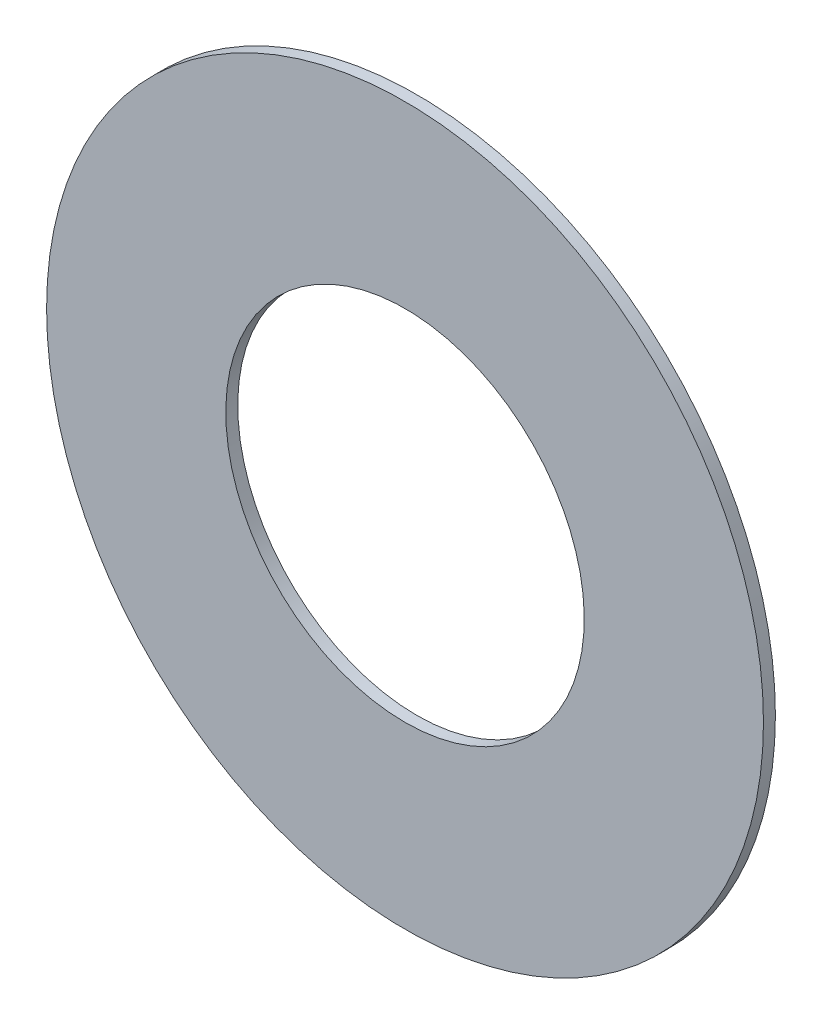
ISO-10303-21;
HEADER;
FILE_DESCRIPTION(('STEP AP214'),'2;1');
FILE_NAME('part.step','',(''),(''),'','','');
FILE_SCHEMA(('AUTOMOTIVE_DESIGN { 1 0 10303 214 1 1 1 1 }'));
ENDSEC;
DATA;
#1=APPLICATION_CONTEXT('core data for automotive mechanical design processes');
#2=APPLICATION_PROTOCOL_DEFINITION('international standard','automotive_design',2000,#1);
#3=PRODUCT_CONTEXT('',#1,'mechanical');
#4=PRODUCT('Part','Part','',(#3));
#5=PRODUCT_RELATED_PRODUCT_CATEGORY('part','',(#4));
#6=PRODUCT_DEFINITION_FORMATION('','',#4);
#7=PRODUCT_DEFINITION_CONTEXT('part definition',#1,'design');
#8=PRODUCT_DEFINITION('design','',#6,#7);
#9=PRODUCT_DEFINITION_SHAPE('','',#8);
#10=(LENGTH_UNIT() NAMED_UNIT(*) SI_UNIT(.MILLI.,.METRE.));
#11=(NAMED_UNIT(*) PLANE_ANGLE_UNIT() SI_UNIT($,.RADIAN.));
#12=(NAMED_UNIT(*) SI_UNIT($,.STERADIAN.) SOLID_ANGLE_UNIT());
#13=UNCERTAINTY_MEASURE_WITH_UNIT(LENGTH_MEASURE(1.E-05),#10,'distance_accuracy_value','');
#14=(GEOMETRIC_REPRESENTATION_CONTEXT(3) GLOBAL_UNCERTAINTY_ASSIGNED_CONTEXT((#13)) GLOBAL_UNIT_ASSIGNED_CONTEXT((#10,
#11,#12)) REPRESENTATION_CONTEXT('',''));
#15=CARTESIAN_POINT('',(0.,0.,0.));
#16=DIRECTION('',(0.,0.,1.));
#17=DIRECTION('',(1.,0.,0.));
#18=AXIS2_PLACEMENT_3D('',#15,#16,#17);
#19=CARTESIAN_POINT('',(126.802,-111.684,-0.045));
#20=DIRECTION('',(0.,0.,-1.));
#21=DIRECTION('',(0.,-1.,0.));
#22=AXIS2_PLACEMENT_3D('',#19,#20,#21);
#23=CYLINDRICAL_SURFACE('',#22,0.525);
#24=CARTESIAN_POINT('',(126.802,-111.684,-0.035));
#25=DIRECTION('',(0.,0.,-1.));
#26=DIRECTION('',(0.,-1.,0.));
#27=AXIS2_PLACEMENT_3D('',#24,#25,#26);
#28=CIRCLE('',#27,0.525);
#29=CARTESIAN_POINT('',(126.802,-112.209,-0.035));
#30=VERTEX_POINT('',#29);
#31=EDGE_CURVE('E25',#30,#30,#28,.T.);
#32=ORIENTED_EDGE('',*,*,#31,.T.);
#33=DIRECTION('',(0.,0.,1.));
#34=VECTOR('',#33,1.);
#35=CARTESIAN_POINT('',(126.802,-112.209,-0.045));
#36=LINE('',#35,#34);
#37=CARTESIAN_POINT('',(126.802,-112.209,0.));
#38=VERTEX_POINT('',#37);
#39=EDGE_CURVE('E11',#30,#38,#36,.T.);
#40=ORIENTED_EDGE('',*,*,#39,.T.);
#41=CARTESIAN_POINT('',(126.802,-111.684,0.));
#42=DIRECTION('',(0.,0.,-1.));
#43=DIRECTION('',(0.,-1.,0.));
#44=AXIS2_PLACEMENT_3D('',#41,#42,#43);
#45=CIRCLE('',#44,0.525);
#46=EDGE_CURVE('E68',#38,#38,#45,.T.);
#47=ORIENTED_EDGE('',*,*,#46,.F.);
#48=ORIENTED_EDGE('',*,*,#39,.F.);
#49=EDGE_LOOP('',(#32,#40,#47,#48));
#50=FACE_BOUND('',#49,.T.);
#51=ADVANCED_FACE('F17',(#50),#23,.F.);
#52=CARTESIAN_POINT('',(126.802,-111.684,-0.035));
#53=DIRECTION('',(0.,0.,1.));
#54=DIRECTION('',(1.,0.,0.));
#55=AXIS2_PLACEMENT_3D('',#52,#53,#54);
#56=PLANE('',#55);
#57=ORIENTED_EDGE('',*,*,#31,.F.);
#58=EDGE_LOOP('',(#57));
#59=FACE_BOUND('',#58,.T.);
#60=CARTESIAN_POINT('',(126.802,-111.684,-0.035));
#61=DIRECTION('',(0.,0.,1.));
#62=DIRECTION('',(1.,0.,0.));
#63=AXIS2_PLACEMENT_3D('',#60,#61,#62);
#64=CIRCLE('',#63,1.05);
#65=CARTESIAN_POINT('',(127.852,-111.684,-0.035));
#66=VERTEX_POINT('',#65);
#67=EDGE_CURVE('E56',#66,#66,#64,.T.);
#68=ORIENTED_EDGE('',*,*,#67,.F.);
#69=EDGE_LOOP('',(#68));
#70=FACE_BOUND('',#69,.T.);
#71=ADVANCED_FACE('F79',(#59,#70),#56,.F.);
#72=CARTESIAN_POINT('',(126.802,-111.684,0.));
#73=DIRECTION('',(0.,0.,1.));
#74=DIRECTION('',(1.,0.,0.));
#75=AXIS2_PLACEMENT_3D('',#72,#73,#74);
#76=PLANE('',#75);
#77=ORIENTED_EDGE('',*,*,#46,.T.);
#78=EDGE_LOOP('',(#77));
#79=FACE_BOUND('',#78,.T.);
#80=CARTESIAN_POINT('',(126.802,-111.684,0.));
#81=DIRECTION('',(0.,0.,1.));
#82=DIRECTION('',(1.,0.,0.));
#83=AXIS2_PLACEMENT_3D('',#80,#81,#82);
#84=CIRCLE('',#83,1.05);
#85=CARTESIAN_POINT('',(127.852,-111.684,0.));
#86=VERTEX_POINT('',#85);
#87=EDGE_CURVE('E54',#86,#86,#84,.T.);
#88=ORIENTED_EDGE('',*,*,#87,.T.);
#89=EDGE_LOOP('',(#88));
#90=FACE_BOUND('',#89,.T.);
#91=ADVANCED_FACE('F60',(#79,#90),#76,.T.);
#92=CARTESIAN_POINT('',(126.802,-111.684,-0.035));
#93=DIRECTION('',(0.,0.,1.));
#94=DIRECTION('',(1.,0.,0.));
#95=AXIS2_PLACEMENT_3D('',#92,#93,#94);
#96=CYLINDRICAL_SURFACE('',#95,1.05);
#97=ORIENTED_EDGE('',*,*,#87,.F.);
#98=DIRECTION('',(0.,0.,1.));
#99=VECTOR('',#98,1.);
#100=CARTESIAN_POINT('',(127.852,-111.684,-0.035));
#101=LINE('',#100,#99);
#102=EDGE_CURVE('E51',#66,#86,#101,.T.);
#103=ORIENTED_EDGE('',*,*,#102,.F.);
#104=ORIENTED_EDGE('',*,*,#67,.T.);
#105=ORIENTED_EDGE('',*,*,#102,.T.);
#106=EDGE_LOOP('',(#97,#103,#104,#105));
#107=FACE_BOUND('',#106,.T.);
#108=ADVANCED_FACE('F53',(#107),#96,.T.);
#109=CLOSED_SHELL('',(#51,#71,#91,#108));
#110=MANIFOLD_SOLID_BREP('B1',#109);
#111=ADVANCED_BREP_SHAPE_REPRESENTATION('',(#18,#110),#14);
#112=SHAPE_DEFINITION_REPRESENTATION(#9,#111);
ENDSEC;
END-ISO-10303-21;
